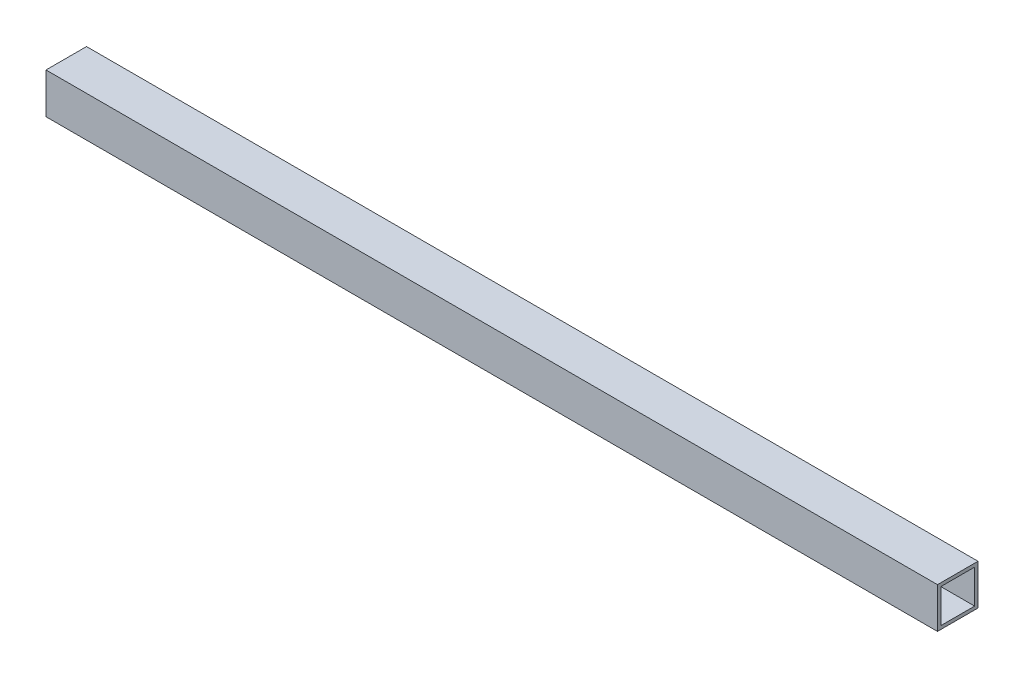
ISO-10303-21;
HEADER;
FILE_DESCRIPTION(('STEP AP214'),'2;1');
FILE_NAME('part.step','',(''),(''),'','','');
FILE_SCHEMA(('AUTOMOTIVE_DESIGN { 1 0 10303 214 1 1 1 1 }'));
ENDSEC;
DATA;
#1=APPLICATION_CONTEXT('core data for automotive mechanical design processes');
#2=APPLICATION_PROTOCOL_DEFINITION('international standard','automotive_design',2000,#1);
#3=PRODUCT_CONTEXT('',#1,'mechanical');
#4=PRODUCT('Part','Part','',(#3));
#5=PRODUCT_RELATED_PRODUCT_CATEGORY('part','',(#4));
#6=PRODUCT_DEFINITION_FORMATION('','',#4);
#7=PRODUCT_DEFINITION_CONTEXT('part definition',#1,'design');
#8=PRODUCT_DEFINITION('design','',#6,#7);
#9=PRODUCT_DEFINITION_SHAPE('','',#8);
#10=(LENGTH_UNIT() NAMED_UNIT(*) SI_UNIT(.MILLI.,.METRE.));
#11=(NAMED_UNIT(*) PLANE_ANGLE_UNIT() SI_UNIT($,.RADIAN.));
#12=(NAMED_UNIT(*) SI_UNIT($,.STERADIAN.) SOLID_ANGLE_UNIT());
#13=UNCERTAINTY_MEASURE_WITH_UNIT(LENGTH_MEASURE(1.E-05),#10,'distance_accuracy_value','');
#14=(GEOMETRIC_REPRESENTATION_CONTEXT(3) GLOBAL_UNCERTAINTY_ASSIGNED_CONTEXT((#13)) GLOBAL_UNIT_ASSIGNED_CONTEXT((#10,
#11,#12)) REPRESENTATION_CONTEXT('',''));
#15=CARTESIAN_POINT('',(0.,0.,0.));
#16=DIRECTION('',(0.,0.,1.));
#17=DIRECTION('',(1.,0.,0.));
#18=AXIS2_PLACEMENT_3D('',#15,#16,#17);
#19=CARTESIAN_POINT('',(0.,0.,-38.1));
#20=DIRECTION('',(-1.,0.,0.));
#21=DIRECTION('',(0.,0.,1.));
#22=AXIS2_PLACEMENT_3D('',#19,#20,#21);
#23=PLANE('',#22);
#24=DIRECTION('',(0.,0.,1.));
#25=VECTOR('',#24,1.);
#26=CARTESIAN_POINT('',(0.,34.925,-34.925));
#27=LINE('',#26,#25);
#28=CARTESIAN_POINT('',(0.,34.925,-34.925));
#29=VERTEX_POINT('',#28);
#30=CARTESIAN_POINT('',(0.,34.925,-3.175));
#31=VERTEX_POINT('',#30);
#32=EDGE_CURVE('E106',#29,#31,#27,.T.);
#33=ORIENTED_EDGE('',*,*,#32,.T.);
#34=DIRECTION('',(0.,1.,0.));
#35=VECTOR('',#34,1.);
#36=CARTESIAN_POINT('',(0.,3.175,-3.175));
#37=LINE('',#36,#35);
#38=CARTESIAN_POINT('',(0.,3.175,-3.175));
#39=VERTEX_POINT('',#38);
#40=EDGE_CURVE('E99',#39,#31,#37,.T.);
#41=ORIENTED_EDGE('',*,*,#40,.F.);
#42=DIRECTION('',(0.,0.,1.));
#43=VECTOR('',#42,1.);
#44=CARTESIAN_POINT('',(0.,3.175,-34.925));
#45=LINE('',#44,#43);
#46=CARTESIAN_POINT('',(0.,3.175,-34.925));
#47=VERTEX_POINT('',#46);
#48=EDGE_CURVE('E105',#47,#39,#45,.T.);
#49=ORIENTED_EDGE('',*,*,#48,.F.);
#50=DIRECTION('',(0.,1.,0.));
#51=VECTOR('',#50,1.);
#52=CARTESIAN_POINT('',(0.,3.175,-34.925));
#53=LINE('',#52,#51);
#54=EDGE_CURVE('E116',#47,#29,#53,.T.);
#55=ORIENTED_EDGE('',*,*,#54,.T.);
#56=EDGE_LOOP('',(#33,#41,#49,#55));
#57=FACE_BOUND('',#56,.T.);
#58=DIRECTION('',(0.,-1.,0.));
#59=VECTOR('',#58,1.);
#60=CARTESIAN_POINT('',(0.,0.,0.));
#61=LINE('',#60,#59);
#62=CARTESIAN_POINT('',(0.,38.1,0.));
#63=VERTEX_POINT('',#62);
#64=CARTESIAN_POINT('',(0.,0.,0.));
#65=VERTEX_POINT('',#64);
#66=EDGE_CURVE('E130',#63,#65,#61,.T.);
#67=ORIENTED_EDGE('',*,*,#66,.F.);
#68=DIRECTION('',(0.,0.,1.));
#69=VECTOR('',#68,1.);
#70=CARTESIAN_POINT('',(0.,38.1,-38.1));
#71=LINE('',#70,#69);
#72=CARTESIAN_POINT('',(0.,38.1,-38.1));
#73=VERTEX_POINT('',#72);
#74=EDGE_CURVE('E169',#73,#63,#71,.T.);
#75=ORIENTED_EDGE('',*,*,#74,.F.);
#76=DIRECTION('',(0.,-1.,0.));
#77=VECTOR('',#76,1.);
#78=CARTESIAN_POINT('',(0.,0.,-38.1));
#79=LINE('',#78,#77);
#80=CARTESIAN_POINT('',(0.,0.,-38.1));
#81=VERTEX_POINT('',#80);
#82=EDGE_CURVE('E137',#73,#81,#79,.T.);
#83=ORIENTED_EDGE('',*,*,#82,.T.);
#84=DIRECTION('',(0.,0.,1.));
#85=VECTOR('',#84,1.);
#86=CARTESIAN_POINT('',(0.,0.,-38.1));
#87=LINE('',#86,#85);
#88=EDGE_CURVE('E154',#81,#65,#87,.T.);
#89=ORIENTED_EDGE('',*,*,#88,.T.);
#90=EDGE_LOOP('',(#67,#75,#83,#89));
#91=FACE_BOUND('',#90,.T.);
#92=ADVANCED_FACE('F38',(#57,#91),#23,.T.);
#93=CARTESIAN_POINT('',(0.,38.1,-38.1));
#94=DIRECTION('',(0.,1.,0.));
#95=DIRECTION('',(0.,0.,1.));
#96=AXIS2_PLACEMENT_3D('',#93,#94,#95);
#97=PLANE('',#96);
#98=DIRECTION('',(-1.,0.,0.));
#99=VECTOR('',#98,1.);
#100=CARTESIAN_POINT('',(0.,38.1,0.));
#101=LINE('',#100,#99);
#102=CARTESIAN_POINT('',(838.1,38.1,0.));
#103=VERTEX_POINT('',#102);
#104=EDGE_CURVE('E142',#103,#63,#101,.T.);
#105=ORIENTED_EDGE('',*,*,#104,.F.);
#106=DIRECTION('',(0.,0.,1.));
#107=VECTOR('',#106,1.);
#108=CARTESIAN_POINT('',(838.1,38.1,-38.1));
#109=LINE('',#108,#107);
#110=CARTESIAN_POINT('',(838.1,38.1,-38.1));
#111=VERTEX_POINT('',#110);
#112=EDGE_CURVE('E173',#111,#103,#109,.T.);
#113=ORIENTED_EDGE('',*,*,#112,.F.);
#114=DIRECTION('',(-1.,0.,0.));
#115=VECTOR('',#114,1.);
#116=CARTESIAN_POINT('',(0.,38.1,-38.1));
#117=LINE('',#116,#115);
#118=EDGE_CURVE('E150',#111,#73,#117,.T.);
#119=ORIENTED_EDGE('',*,*,#118,.T.);
#120=ORIENTED_EDGE('',*,*,#74,.T.);
#121=EDGE_LOOP('',(#105,#113,#119,#120));
#122=FACE_BOUND('',#121,.T.);
#123=ADVANCED_FACE('F204',(#122),#97,.T.);
#124=CARTESIAN_POINT('',(838.1,0.,-38.1));
#125=DIRECTION('',(1.,0.,0.));
#126=DIRECTION('',(0.,0.,-1.));
#127=AXIS2_PLACEMENT_3D('',#124,#125,#126);
#128=PLANE('',#127);
#129=DIRECTION('',(0.,0.,1.));
#130=VECTOR('',#129,1.);
#131=CARTESIAN_POINT('',(838.1,34.925,-38.1));
#132=LINE('',#131,#130);
#133=CARTESIAN_POINT('',(838.1,34.925,-34.925));
#134=VERTEX_POINT('',#133);
#135=CARTESIAN_POINT('',(838.1,34.925,-3.175));
#136=VERTEX_POINT('',#135);
#137=EDGE_CURVE('E11',#134,#136,#132,.T.);
#138=ORIENTED_EDGE('',*,*,#137,.F.);
#139=DIRECTION('',(0.,1.,0.));
#140=VECTOR('',#139,1.);
#141=CARTESIAN_POINT('',(838.1,0.,-34.925));
#142=LINE('',#141,#140);
#143=CARTESIAN_POINT('',(838.1,3.175,-34.925));
#144=VERTEX_POINT('',#143);
#145=EDGE_CURVE('E46',#144,#134,#142,.T.);
#146=ORIENTED_EDGE('',*,*,#145,.F.);
#147=DIRECTION('',(0.,0.,1.));
#148=VECTOR('',#147,1.);
#149=CARTESIAN_POINT('',(838.1,3.175,-38.1));
#150=LINE('',#149,#148);
#151=CARTESIAN_POINT('',(838.1,3.175,-3.175));
#152=VERTEX_POINT('',#151);
#153=EDGE_CURVE('E183',#144,#152,#150,.T.);
#154=ORIENTED_EDGE('',*,*,#153,.T.);
#155=DIRECTION('',(0.,1.,0.));
#156=VECTOR('',#155,1.);
#157=CARTESIAN_POINT('',(838.1,0.,-3.175));
#158=LINE('',#157,#156);
#159=EDGE_CURVE('E172',#152,#136,#158,.T.);
#160=ORIENTED_EDGE('',*,*,#159,.T.);
#161=EDGE_LOOP('',(#138,#146,#154,#160));
#162=FACE_BOUND('',#161,.T.);
#163=DIRECTION('',(0.,1.,0.));
#164=VECTOR('',#163,1.);
#165=CARTESIAN_POINT('',(838.1,0.,0.));
#166=LINE('',#165,#164);
#167=CARTESIAN_POINT('',(838.1,0.,0.));
#168=VERTEX_POINT('',#167);
#169=EDGE_CURVE('E162',#168,#103,#166,.T.);
#170=ORIENTED_EDGE('',*,*,#169,.F.);
#171=DIRECTION('',(0.,0.,1.));
#172=VECTOR('',#171,1.);
#173=CARTESIAN_POINT('',(838.1,0.,-38.1));
#174=LINE('',#173,#172);
#175=CARTESIAN_POINT('',(838.1,0.,-38.1));
#176=VERTEX_POINT('',#175);
#177=EDGE_CURVE('E176',#176,#168,#174,.T.);
#178=ORIENTED_EDGE('',*,*,#177,.F.);
#179=DIRECTION('',(0.,1.,0.));
#180=VECTOR('',#179,1.);
#181=CARTESIAN_POINT('',(838.1,0.,-38.1));
#182=LINE('',#181,#180);
#183=EDGE_CURVE('E146',#176,#111,#182,.T.);
#184=ORIENTED_EDGE('',*,*,#183,.T.);
#185=ORIENTED_EDGE('',*,*,#112,.T.);
#186=EDGE_LOOP('',(#170,#178,#184,#185));
#187=FACE_BOUND('',#186,.T.);
#188=ADVANCED_FACE('F191',(#162,#187),#128,.T.);
#189=CARTESIAN_POINT('',(0.,0.,-38.1));
#190=DIRECTION('',(0.,-1.,0.));
#191=DIRECTION('',(0.,0.,-1.));
#192=AXIS2_PLACEMENT_3D('',#189,#190,#191);
#193=PLANE('',#192);
#194=DIRECTION('',(1.,0.,0.));
#195=VECTOR('',#194,1.);
#196=CARTESIAN_POINT('',(0.,0.,0.));
#197=LINE('',#196,#195);
#198=EDGE_CURVE('E158',#65,#168,#197,.T.);
#199=ORIENTED_EDGE('',*,*,#198,.F.);
#200=ORIENTED_EDGE('',*,*,#88,.F.);
#201=DIRECTION('',(1.,0.,0.));
#202=VECTOR('',#201,1.);
#203=CARTESIAN_POINT('',(0.,0.,-38.1));
#204=LINE('',#203,#202);
#205=EDGE_CURVE('E141',#81,#176,#204,.T.);
#206=ORIENTED_EDGE('',*,*,#205,.T.);
#207=ORIENTED_EDGE('',*,*,#177,.T.);
#208=EDGE_LOOP('',(#199,#200,#206,#207));
#209=FACE_BOUND('',#208,.T.);
#210=ADVANCED_FACE('F215',(#209),#193,.T.);
#211=CARTESIAN_POINT('',(0.,0.,-38.1));
#212=DIRECTION('',(0.,0.,-1.));
#213=DIRECTION('',(-1.,0.,0.));
#214=AXIS2_PLACEMENT_3D('',#211,#212,#213);
#215=PLANE('',#214);
#216=ORIENTED_EDGE('',*,*,#82,.F.);
#217=ORIENTED_EDGE('',*,*,#118,.F.);
#218=ORIENTED_EDGE('',*,*,#183,.F.);
#219=ORIENTED_EDGE('',*,*,#205,.F.);
#220=EDGE_LOOP('',(#216,#217,#218,#219));
#221=FACE_BOUND('',#220,.T.);
#222=ADVANCED_FACE('F222',(#221),#215,.T.);
#223=CARTESIAN_POINT('',(0.,0.,0.));
#224=DIRECTION('',(0.,0.,-1.));
#225=DIRECTION('',(-1.,0.,0.));
#226=AXIS2_PLACEMENT_3D('',#223,#224,#225);
#227=PLANE('',#226);
#228=ORIENTED_EDGE('',*,*,#66,.T.);
#229=ORIENTED_EDGE('',*,*,#198,.T.);
#230=ORIENTED_EDGE('',*,*,#169,.T.);
#231=ORIENTED_EDGE('',*,*,#104,.T.);
#232=EDGE_LOOP('',(#228,#229,#230,#231));
#233=FACE_BOUND('',#232,.T.);
#234=ADVANCED_FACE('F219',(#233),#227,.F.);
#235=CARTESIAN_POINT('',(0.,34.925,-34.925));
#236=DIRECTION('',(0.,1.,0.));
#237=DIRECTION('',(0.,0.,1.));
#238=AXIS2_PLACEMENT_3D('',#235,#236,#237);
#239=PLANE('',#238);
#240=ORIENTED_EDGE('',*,*,#137,.T.);
#241=DIRECTION('',(1.,0.,0.));
#242=VECTOR('',#241,1.);
#243=CARTESIAN_POINT('',(0.,34.925,-3.175));
#244=LINE('',#243,#242);
#245=EDGE_CURVE('E58',#31,#136,#244,.T.);
#246=ORIENTED_EDGE('',*,*,#245,.F.);
#247=ORIENTED_EDGE('',*,*,#32,.F.);
#248=DIRECTION('',(1.,0.,0.));
#249=VECTOR('',#248,1.);
#250=CARTESIAN_POINT('',(0.,34.925,-34.925));
#251=LINE('',#250,#249);
#252=EDGE_CURVE('E127',#29,#134,#251,.T.);
#253=ORIENTED_EDGE('',*,*,#252,.T.);
#254=EDGE_LOOP('',(#240,#246,#247,#253));
#255=FACE_BOUND('',#254,.T.);
#256=ADVANCED_FACE('F110',(#255),#239,.F.);
#257=CARTESIAN_POINT('',(0.,3.175,-34.925));
#258=DIRECTION('',(0.,0.,-1.));
#259=DIRECTION('',(0.,1.,0.));
#260=AXIS2_PLACEMENT_3D('',#257,#258,#259);
#261=PLANE('',#260);
#262=ORIENTED_EDGE('',*,*,#145,.T.);
#263=ORIENTED_EDGE('',*,*,#252,.F.);
#264=ORIENTED_EDGE('',*,*,#54,.F.);
#265=DIRECTION('',(1.,0.,0.));
#266=VECTOR('',#265,1.);
#267=CARTESIAN_POINT('',(0.,3.175,-34.925));
#268=LINE('',#267,#266);
#269=EDGE_CURVE('E131',#47,#144,#268,.T.);
#270=ORIENTED_EDGE('',*,*,#269,.T.);
#271=EDGE_LOOP('',(#262,#263,#264,#270));
#272=FACE_BOUND('',#271,.T.);
#273=ADVANCED_FACE('F189',(#272),#261,.F.);
#274=CARTESIAN_POINT('',(0.,3.175,-34.925));
#275=DIRECTION('',(0.,1.,0.));
#276=DIRECTION('',(0.,0.,1.));
#277=AXIS2_PLACEMENT_3D('',#274,#275,#276);
#278=PLANE('',#277);
#279=ORIENTED_EDGE('',*,*,#269,.F.);
#280=ORIENTED_EDGE('',*,*,#48,.T.);
#281=DIRECTION('',(1.,0.,0.));
#282=VECTOR('',#281,1.);
#283=CARTESIAN_POINT('',(0.,3.175,-3.175));
#284=LINE('',#283,#282);
#285=EDGE_CURVE('E53',#39,#152,#284,.T.);
#286=ORIENTED_EDGE('',*,*,#285,.T.);
#287=ORIENTED_EDGE('',*,*,#153,.F.);
#288=EDGE_LOOP('',(#279,#280,#286,#287));
#289=FACE_BOUND('',#288,.T.);
#290=ADVANCED_FACE('F194',(#289),#278,.T.);
#291=CARTESIAN_POINT('',(0.,3.175,-3.175));
#292=DIRECTION('',(0.,0.,-1.));
#293=DIRECTION('',(-1.,0.,0.));
#294=AXIS2_PLACEMENT_3D('',#291,#292,#293);
#295=PLANE('',#294);
#296=ORIENTED_EDGE('',*,*,#285,.F.);
#297=ORIENTED_EDGE('',*,*,#40,.T.);
#298=ORIENTED_EDGE('',*,*,#245,.T.);
#299=ORIENTED_EDGE('',*,*,#159,.F.);
#300=EDGE_LOOP('',(#296,#297,#298,#299));
#301=FACE_BOUND('',#300,.T.);
#302=ADVANCED_FACE('F100',(#301),#295,.T.);
#303=CLOSED_SHELL('',(#92,#123,#188,#210,#222,#234,#256,#273,#290,#302));
#304=MANIFOLD_SOLID_BREP('B2',#303);
#305=ADVANCED_BREP_SHAPE_REPRESENTATION('',(#18,#304),#14);
#306=SHAPE_DEFINITION_REPRESENTATION(#9,#305);
ENDSEC;
END-ISO-10303-21;
